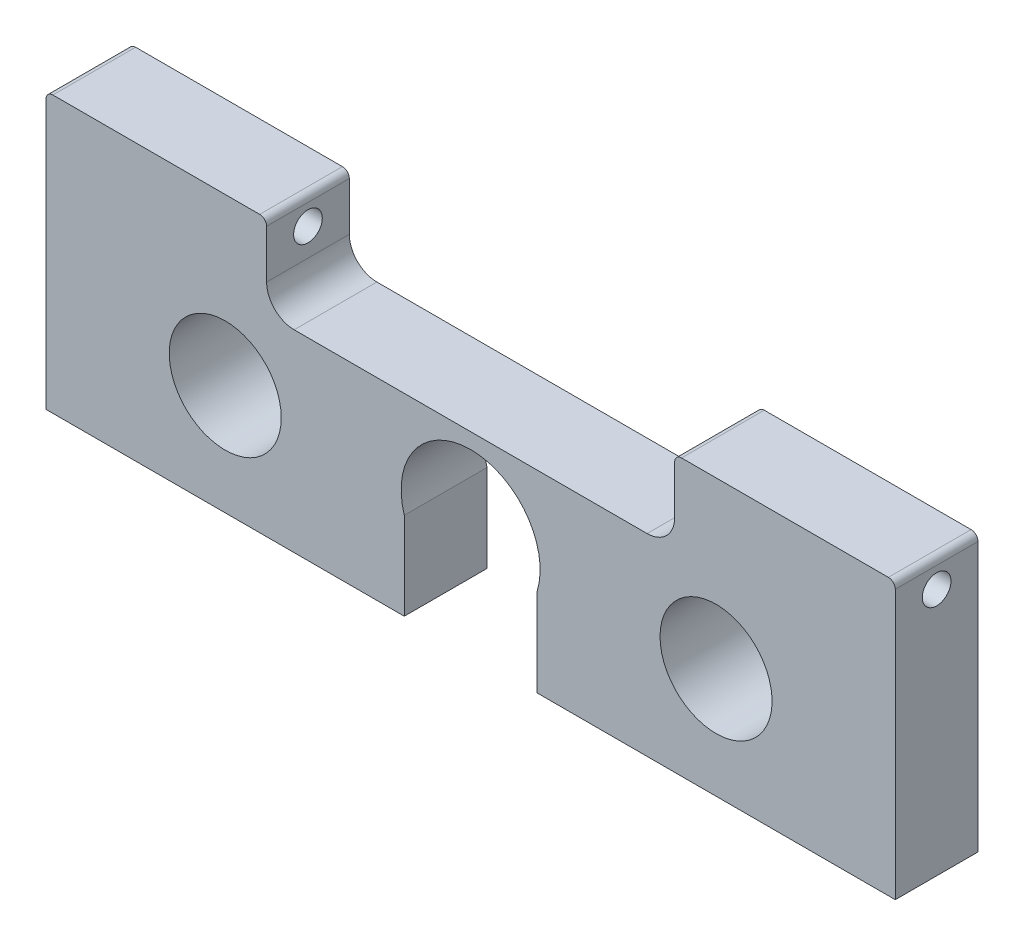
ISO-10303-21;
HEADER;
FILE_DESCRIPTION(('STEP AP214'),'2;1');
FILE_NAME('part.step','',(''),(''),'','','');
FILE_SCHEMA(('AUTOMOTIVE_DESIGN { 1 0 10303 214 1 1 1 1 }'));
ENDSEC;
DATA;
#1=APPLICATION_CONTEXT('core data for automotive mechanical design processes');
#2=APPLICATION_PROTOCOL_DEFINITION('international standard','automotive_design',2000,#1);
#3=PRODUCT_CONTEXT('',#1,'mechanical');
#4=PRODUCT('Part','Part','',(#3));
#5=PRODUCT_RELATED_PRODUCT_CATEGORY('part','',(#4));
#6=PRODUCT_DEFINITION_FORMATION('','',#4);
#7=PRODUCT_DEFINITION_CONTEXT('part definition',#1,'design');
#8=PRODUCT_DEFINITION('design','',#6,#7);
#9=PRODUCT_DEFINITION_SHAPE('','',#8);
#10=(LENGTH_UNIT() NAMED_UNIT(*) SI_UNIT(.MILLI.,.METRE.));
#11=(NAMED_UNIT(*) PLANE_ANGLE_UNIT() SI_UNIT($,.RADIAN.));
#12=(NAMED_UNIT(*) SI_UNIT($,.STERADIAN.) SOLID_ANGLE_UNIT());
#13=UNCERTAINTY_MEASURE_WITH_UNIT(LENGTH_MEASURE(1.E-05),#10,'distance_accuracy_value','');
#14=(GEOMETRIC_REPRESENTATION_CONTEXT(3) GLOBAL_UNCERTAINTY_ASSIGNED_CONTEXT((#13)) GLOBAL_UNIT_ASSIGNED_CONTEXT((#10,
#11,#12)) REPRESENTATION_CONTEXT('',''));
#15=CARTESIAN_POINT('',(0.,0.,0.));
#16=DIRECTION('',(0.,0.,1.));
#17=DIRECTION('',(1.,0.,0.));
#18=AXIS2_PLACEMENT_3D('',#15,#16,#17);
#19=CARTESIAN_POINT('',(97.79,-19.05,19.05));
#20=DIRECTION('',(-1.,0.,0.));
#21=DIRECTION('',(0.,0.,1.));
#22=AXIS2_PLACEMENT_3D('',#19,#20,#21);
#23=PLANE('',#22);
#24=CARTESIAN_POINT('',(97.79,31.75,9.525));
#25=DIRECTION('',(-1.,0.,0.));
#26=DIRECTION('',(0.,0.,1.));
#27=AXIS2_PLACEMENT_3D('',#24,#25,#26);
#28=CIRCLE('',#27,3.302);
#29=CARTESIAN_POINT('',(97.79,31.75,12.827));
#30=VERTEX_POINT('',#29);
#31=EDGE_CURVE('E227',#30,#30,#28,.T.);
#32=ORIENTED_EDGE('',*,*,#31,.T.);
#33=EDGE_LOOP('',(#32));
#34=FACE_BOUND('',#33,.T.);
#35=DIRECTION('',(0.,1.,0.));
#36=VECTOR('',#35,1.);
#37=CARTESIAN_POINT('',(97.79,-19.05,0.));
#38=LINE('',#37,#36);
#39=CARTESIAN_POINT('',(97.79,-25.4,0.));
#40=VERTEX_POINT('',#39);
#41=CARTESIAN_POINT('',(97.79,36.5125,0.));
#42=VERTEX_POINT('',#41);
#43=EDGE_CURVE('E199',#40,#42,#38,.T.);
#44=ORIENTED_EDGE('',*,*,#43,.T.);
#45=DIRECTION('',(0.,0.,-1.));
#46=VECTOR('',#45,1.);
#47=CARTESIAN_POINT('',(97.79,36.5125,19.05));
#48=LINE('',#47,#46);
#49=CARTESIAN_POINT('',(97.79,36.5125,19.05));
#50=VERTEX_POINT('',#49);
#51=EDGE_CURVE('E271',#42,#50,#48,.F.);
#52=ORIENTED_EDGE('',*,*,#51,.T.);
#53=DIRECTION('',(0.,1.,0.));
#54=VECTOR('',#53,1.);
#55=CARTESIAN_POINT('',(97.79,-19.05,19.05));
#56=LINE('',#55,#54);
#57=CARTESIAN_POINT('',(97.79,-25.4,19.05));
#58=VERTEX_POINT('',#57);
#59=EDGE_CURVE('E202',#58,#50,#56,.T.);
#60=ORIENTED_EDGE('',*,*,#59,.F.);
#61=DIRECTION('',(0.,0.,1.));
#62=VECTOR('',#61,1.);
#63=CARTESIAN_POINT('',(97.79,-25.4,-87.0286549798374));
#64=LINE('',#63,#62);
#65=EDGE_CURVE('E324',#40,#58,#64,.T.);
#66=ORIENTED_EDGE('',*,*,#65,.F.);
#67=EDGE_LOOP('',(#44,#52,#60,#66));
#68=FACE_BOUND('',#67,.T.);
#69=ADVANCED_FACE('F35',(#34,#68),#23,.F.);
#70=CARTESIAN_POINT('',(-97.79,19.05,19.05));
#71=DIRECTION('',(0.,-1.,0.));
#72=DIRECTION('',(0.,0.,-1.));
#73=AXIS2_PLACEMENT_3D('',#70,#71,#72);
#74=PLANE('',#73);
#75=DIRECTION('',(-1.,0.,0.));
#76=VECTOR('',#75,1.);
#77=CARTESIAN_POINT('',(-97.79,19.05,19.05));
#78=LINE('',#77,#76);
#79=CARTESIAN_POINT('',(40.64,19.05,19.05));
#80=VERTEX_POINT('',#79);
#81=CARTESIAN_POINT('',(-40.64,19.05,19.05));
#82=VERTEX_POINT('',#81);
#83=EDGE_CURVE('E205',#80,#82,#78,.T.);
#84=ORIENTED_EDGE('',*,*,#83,.F.);
#85=DIRECTION('',(0.,0.,1.));
#86=VECTOR('',#85,1.);
#87=CARTESIAN_POINT('',(40.64,19.05,19.05));
#88=LINE('',#87,#86);
#89=CARTESIAN_POINT('',(40.64,19.05,0.));
#90=VERTEX_POINT('',#89);
#91=EDGE_CURVE('E233',#80,#90,#88,.F.);
#92=ORIENTED_EDGE('',*,*,#91,.T.);
#93=DIRECTION('',(-1.,0.,0.));
#94=VECTOR('',#93,1.);
#95=CARTESIAN_POINT('',(-97.79,19.05,0.));
#96=LINE('',#95,#94);
#97=CARTESIAN_POINT('',(-40.64,19.05,0.));
#98=VERTEX_POINT('',#97);
#99=EDGE_CURVE('E214',#90,#98,#96,.T.);
#100=ORIENTED_EDGE('',*,*,#99,.T.);
#101=DIRECTION('',(0.,0.,1.));
#102=VECTOR('',#101,1.);
#103=CARTESIAN_POINT('',(-40.64,19.05,19.05));
#104=LINE('',#103,#102);
#105=EDGE_CURVE('E230',#98,#82,#104,.T.);
#106=ORIENTED_EDGE('',*,*,#105,.T.);
#107=EDGE_LOOP('',(#84,#92,#100,#106));
#108=FACE_BOUND('',#107,.T.);
#109=ADVANCED_FACE('F369',(#108),#74,.F.);
#110=CARTESIAN_POINT('',(-97.79,-19.05,19.05));
#111=DIRECTION('',(1.,0.,0.));
#112=DIRECTION('',(0.,0.,-1.));
#113=AXIS2_PLACEMENT_3D('',#110,#111,#112);
#114=PLANE('',#113);
#115=CARTESIAN_POINT('',(-97.79,31.75,9.525));
#116=DIRECTION('',(-1.,0.,0.));
#117=DIRECTION('',(0.,0.,1.));
#118=AXIS2_PLACEMENT_3D('',#115,#116,#117);
#119=CIRCLE('',#118,3.302);
#120=CARTESIAN_POINT('',(-97.79,31.75,12.827));
#121=VERTEX_POINT('',#120);
#122=EDGE_CURVE('E222',#121,#121,#119,.T.);
#123=ORIENTED_EDGE('',*,*,#122,.F.);
#124=EDGE_LOOP('',(#123));
#125=FACE_BOUND('',#124,.T.);
#126=DIRECTION('',(0.,-1.,0.));
#127=VECTOR('',#126,1.);
#128=CARTESIAN_POINT('',(-97.79,-19.05,19.05));
#129=LINE('',#128,#127);
#130=CARTESIAN_POINT('',(-97.79,36.5125,19.05));
#131=VERTEX_POINT('',#130);
#132=CARTESIAN_POINT('',(-97.79,-25.4,19.05));
#133=VERTEX_POINT('',#132);
#134=EDGE_CURVE('E209',#131,#133,#129,.T.);
#135=ORIENTED_EDGE('',*,*,#134,.F.);
#136=DIRECTION('',(0.,0.,-1.));
#137=VECTOR('',#136,1.);
#138=CARTESIAN_POINT('',(-97.79,36.5125,0.));
#139=LINE('',#138,#137);
#140=CARTESIAN_POINT('',(-97.79,36.5125,0.));
#141=VERTEX_POINT('',#140);
#142=EDGE_CURVE('E12',#131,#141,#139,.T.);
#143=ORIENTED_EDGE('',*,*,#142,.T.);
#144=DIRECTION('',(0.,-1.,0.));
#145=VECTOR('',#144,1.);
#146=CARTESIAN_POINT('',(-97.79,-19.05,0.));
#147=LINE('',#146,#145);
#148=CARTESIAN_POINT('',(-97.79,-25.4,0.));
#149=VERTEX_POINT('',#148);
#150=EDGE_CURVE('E206',#141,#149,#147,.T.);
#151=ORIENTED_EDGE('',*,*,#150,.T.);
#152=DIRECTION('',(0.,0.,1.));
#153=VECTOR('',#152,1.);
#154=CARTESIAN_POINT('',(-97.79,-25.4,-87.0286549798374));
#155=LINE('',#154,#153);
#156=EDGE_CURVE('E317',#149,#133,#155,.T.);
#157=ORIENTED_EDGE('',*,*,#156,.T.);
#158=EDGE_LOOP('',(#135,#143,#151,#157));
#159=FACE_BOUND('',#158,.T.);
#160=ADVANCED_FACE('F392',(#125,#159),#114,.F.);
#161=CARTESIAN_POINT('',(0.,0.,19.05));
#162=DIRECTION('',(0.,0.,-1.));
#163=DIRECTION('',(-1.,0.,0.));
#164=AXIS2_PLACEMENT_3D('',#161,#162,#163);
#165=PLANE('',#164);
#166=CARTESIAN_POINT('',(56.5150000000001,0.,19.05));
#167=DIRECTION('',(0.,0.,1.));
#168=DIRECTION('',(-1.,0.,0.));
#169=AXIS2_PLACEMENT_3D('',#166,#167,#168);
#170=CIRCLE('',#169,12.8984375);
#171=CARTESIAN_POINT('',(43.6165625000001,0.,19.05));
#172=VERTEX_POINT('',#171);
#173=EDGE_CURVE('E176',#172,#172,#170,.T.);
#174=ORIENTED_EDGE('',*,*,#173,.F.);
#175=EDGE_LOOP('',(#174));
#176=FACE_BOUND('',#175,.T.);
#177=CARTESIAN_POINT('',(-56.515,0.,19.05));
#178=DIRECTION('',(0.,0.,1.));
#179=DIRECTION('',(1.,0.,0.));
#180=AXIS2_PLACEMENT_3D('',#177,#178,#179);
#181=CIRCLE('',#180,12.8984375);
#182=CARTESIAN_POINT('',(-43.6165625,0.,19.05));
#183=VERTEX_POINT('',#182);
#184=EDGE_CURVE('E193',#183,#183,#181,.T.);
#185=ORIENTED_EDGE('',*,*,#184,.F.);
#186=EDGE_LOOP('',(#185));
#187=FACE_BOUND('',#186,.T.);
#188=CARTESIAN_POINT('',(0.,-0.508,19.05));
#189=DIRECTION('',(0.,0.,1.));
#190=DIRECTION('',(1.,0.,0.));
#191=AXIS2_PLACEMENT_3D('',#188,#189,#190);
#192=CIRCLE('',#191,16.0019999876822);
#193=CARTESIAN_POINT('',(15.2818809037791,-5.25437963594282,19.05));
#194=VERTEX_POINT('',#193);
#195=CARTESIAN_POINT('',(-15.2818809037791,-5.25437963594281,19.05));
#196=VERTEX_POINT('',#195);
#197=EDGE_CURVE('E175',#194,#196,#192,.T.);
#198=ORIENTED_EDGE('',*,*,#197,.F.);
#199=DIRECTION('',(0.,-1.,0.));
#200=VECTOR('',#199,1.);
#201=CARTESIAN_POINT('',(15.2818809037791,0.,19.05));
#202=LINE('',#201,#200);
#203=CARTESIAN_POINT('',(15.2818809037791,-25.4,19.05));
#204=VERTEX_POINT('',#203);
#205=EDGE_CURVE('E332',#194,#204,#202,.T.);
#206=ORIENTED_EDGE('',*,*,#205,.T.);
#207=DIRECTION('',(1.,0.,0.));
#208=VECTOR('',#207,1.);
#209=CARTESIAN_POINT('',(10.9933163790253,-25.4,19.05));
#210=LINE('',#209,#208);
#211=EDGE_CURVE('E329',#204,#58,#210,.T.);
#212=ORIENTED_EDGE('',*,*,#211,.T.);
#213=ORIENTED_EDGE('',*,*,#59,.T.);
#214=CARTESIAN_POINT('',(96.2025,36.5125,19.05));
#215=DIRECTION('',(0.,0.,-1.));
#216=DIRECTION('',(-1.,0.,0.));
#217=AXIS2_PLACEMENT_3D('',#214,#215,#216);
#218=CIRCLE('',#217,1.5875);
#219=CARTESIAN_POINT('',(96.2025,38.1,19.05));
#220=VERTEX_POINT('',#219);
#221=EDGE_CURVE('E267',#50,#220,#218,.F.);
#222=ORIENTED_EDGE('',*,*,#221,.T.);
#223=DIRECTION('',(1.,0.,0.));
#224=VECTOR('',#223,1.);
#225=CARTESIAN_POINT('',(46.99,38.1,19.05));
#226=LINE('',#225,#224);
#227=CARTESIAN_POINT('',(48.5775,38.1,19.05));
#228=VERTEX_POINT('',#227);
#229=EDGE_CURVE('E304',#228,#220,#226,.T.);
#230=ORIENTED_EDGE('',*,*,#229,.F.);
#231=CARTESIAN_POINT('',(48.5775,36.5125,19.05));
#232=DIRECTION('',(0.,0.,-1.));
#233=DIRECTION('',(-1.,0.,0.));
#234=AXIS2_PLACEMENT_3D('',#231,#232,#233);
#235=CIRCLE('',#234,1.5875);
#236=CARTESIAN_POINT('',(46.99,36.5125,19.05));
#237=VERTEX_POINT('',#236);
#238=EDGE_CURVE('E269',#228,#237,#235,.F.);
#239=ORIENTED_EDGE('',*,*,#238,.T.);
#240=DIRECTION('',(0.,1.,0.));
#241=VECTOR('',#240,1.);
#242=CARTESIAN_POINT('',(46.99,19.05,19.05));
#243=LINE('',#242,#241);
#244=CARTESIAN_POINT('',(46.99,25.4,19.05));
#245=VERTEX_POINT('',#244);
#246=EDGE_CURVE('E308',#245,#237,#243,.T.);
#247=ORIENTED_EDGE('',*,*,#246,.F.);
#248=CARTESIAN_POINT('',(40.64,25.4,19.05));
#249=DIRECTION('',(0.,0.,-1.));
#250=DIRECTION('',(-1.,0.,0.));
#251=AXIS2_PLACEMENT_3D('',#248,#249,#250);
#252=CIRCLE('',#251,6.35);
#253=EDGE_CURVE('E238',#245,#80,#252,.T.);
#254=ORIENTED_EDGE('',*,*,#253,.T.);
#255=ORIENTED_EDGE('',*,*,#83,.T.);
#256=CARTESIAN_POINT('',(-40.64,25.4,19.05));
#257=DIRECTION('',(0.,0.,-1.));
#258=DIRECTION('',(-1.,0.,0.));
#259=AXIS2_PLACEMENT_3D('',#256,#257,#258);
#260=CIRCLE('',#259,6.35);
#261=CARTESIAN_POINT('',(-46.99,25.4,19.05));
#262=VERTEX_POINT('',#261);
#263=EDGE_CURVE('E243',#82,#262,#260,.T.);
#264=ORIENTED_EDGE('',*,*,#263,.T.);
#265=DIRECTION('',(0.,1.,0.));
#266=VECTOR('',#265,1.);
#267=CARTESIAN_POINT('',(-46.99,19.05,19.05));
#268=LINE('',#267,#266);
#269=CARTESIAN_POINT('',(-46.99,36.5125,19.05));
#270=VERTEX_POINT('',#269);
#271=EDGE_CURVE('E283',#262,#270,#268,.T.);
#272=ORIENTED_EDGE('',*,*,#271,.T.);
#273=CARTESIAN_POINT('',(-48.5775,36.5125,19.05));
#274=DIRECTION('',(0.,0.,-1.));
#275=DIRECTION('',(-1.,0.,0.));
#276=AXIS2_PLACEMENT_3D('',#273,#274,#275);
#277=CIRCLE('',#276,1.5875);
#278=CARTESIAN_POINT('',(-48.5775,38.1,19.05));
#279=VERTEX_POINT('',#278);
#280=EDGE_CURVE('E265',#270,#279,#277,.F.);
#281=ORIENTED_EDGE('',*,*,#280,.T.);
#282=DIRECTION('',(-1.,0.,0.));
#283=VECTOR('',#282,1.);
#284=CARTESIAN_POINT('',(-46.99,38.1,19.05));
#285=LINE('',#284,#283);
#286=CARTESIAN_POINT('',(-96.2025,38.1,19.05));
#287=VERTEX_POINT('',#286);
#288=EDGE_CURVE('E187',#279,#287,#285,.T.);
#289=ORIENTED_EDGE('',*,*,#288,.T.);
#290=CARTESIAN_POINT('',(-96.2025,36.5125,19.05));
#291=DIRECTION('',(0.,0.,-1.));
#292=DIRECTION('',(-1.,0.,0.));
#293=AXIS2_PLACEMENT_3D('',#290,#291,#292);
#294=CIRCLE('',#293,1.5875);
#295=EDGE_CURVE('E263',#287,#131,#294,.F.);
#296=ORIENTED_EDGE('',*,*,#295,.T.);
#297=ORIENTED_EDGE('',*,*,#134,.T.);
#298=DIRECTION('',(1.,0.,0.));
#299=VECTOR('',#298,1.);
#300=CARTESIAN_POINT('',(-97.79,-25.4,19.05));
#301=LINE('',#300,#299);
#302=CARTESIAN_POINT('',(-15.2818809037791,-25.4,19.05));
#303=VERTEX_POINT('',#302);
#304=EDGE_CURVE('E320',#133,#303,#301,.T.);
#305=ORIENTED_EDGE('',*,*,#304,.T.);
#306=DIRECTION('',(0.,1.,0.));
#307=VECTOR('',#306,1.);
#308=CARTESIAN_POINT('',(-15.2818809037791,0.,19.05));
#309=LINE('',#308,#307);
#310=EDGE_CURVE('E50',#303,#196,#309,.T.);
#311=ORIENTED_EDGE('',*,*,#310,.T.);
#312=EDGE_LOOP('',(#198,#206,#212,#213,#222,#230,#239,#247,#254,#255,#264,#272,#281,#289,#296,
#297,#305,#311));
#313=FACE_BOUND('',#312,.T.);
#314=ADVANCED_FACE('F288',(#176,#187,#313),#165,.F.);
#315=CARTESIAN_POINT('',(0.,0.,0.));
#316=DIRECTION('',(0.,0.,-1.));
#317=DIRECTION('',(-1.,0.,0.));
#318=AXIS2_PLACEMENT_3D('',#315,#316,#317);
#319=PLANE('',#318);
#320=DIRECTION('',(0.,1.,0.));
#321=VECTOR('',#320,1.);
#322=CARTESIAN_POINT('',(15.2818809037791,-5.25437963594282,0.));
#323=LINE('',#322,#321);
#324=CARTESIAN_POINT('',(15.2818809037791,-25.4,0.));
#325=VERTEX_POINT('',#324);
#326=CARTESIAN_POINT('',(15.2818809037791,-5.25437963594282,0.));
#327=VERTEX_POINT('',#326);
#328=EDGE_CURVE('E58',#325,#327,#323,.T.);
#329=ORIENTED_EDGE('',*,*,#328,.T.);
#330=CARTESIAN_POINT('',(0.,-0.508,0.));
#331=DIRECTION('',(0.,0.,1.));
#332=DIRECTION('',(1.,0.,0.));
#333=AXIS2_PLACEMENT_3D('',#330,#331,#332);
#334=CIRCLE('',#333,16.0019999876822);
#335=CARTESIAN_POINT('',(-15.2818809037791,-5.25437963594281,0.));
#336=VERTEX_POINT('',#335);
#337=EDGE_CURVE('E173',#327,#336,#334,.T.);
#338=ORIENTED_EDGE('',*,*,#337,.T.);
#339=DIRECTION('',(0.,-1.,0.));
#340=VECTOR('',#339,1.);
#341=CARTESIAN_POINT('',(-15.2818809037791,-5.25437963594281,0.));
#342=LINE('',#341,#340);
#343=CARTESIAN_POINT('',(-15.2818809037791,-25.4,0.));
#344=VERTEX_POINT('',#343);
#345=EDGE_CURVE('E158',#336,#344,#342,.T.);
#346=ORIENTED_EDGE('',*,*,#345,.T.);
#347=DIRECTION('',(1.,0.,0.));
#348=VECTOR('',#347,1.);
#349=CARTESIAN_POINT('',(-97.79,-25.4,0.));
#350=LINE('',#349,#348);
#351=EDGE_CURVE('E316',#149,#344,#350,.T.);
#352=ORIENTED_EDGE('',*,*,#351,.F.);
#353=ORIENTED_EDGE('',*,*,#150,.F.);
#354=CARTESIAN_POINT('',(-96.2025,36.5125,0.));
#355=DIRECTION('',(0.,0.,-1.));
#356=DIRECTION('',(-1.,0.,0.));
#357=AXIS2_PLACEMENT_3D('',#354,#355,#356);
#358=CIRCLE('',#357,1.5875);
#359=CARTESIAN_POINT('',(-96.2025,38.1,0.));
#360=VERTEX_POINT('',#359);
#361=EDGE_CURVE('E250',#141,#360,#358,.T.);
#362=ORIENTED_EDGE('',*,*,#361,.T.);
#363=DIRECTION('',(-1.,0.,0.));
#364=VECTOR('',#363,1.);
#365=CARTESIAN_POINT('',(-46.99,38.1,0.));
#366=LINE('',#365,#364);
#367=CARTESIAN_POINT('',(-48.5775,38.1,0.));
#368=VERTEX_POINT('',#367);
#369=EDGE_CURVE('E184',#368,#360,#366,.T.);
#370=ORIENTED_EDGE('',*,*,#369,.F.);
#371=CARTESIAN_POINT('',(-48.5775,36.5125,0.));
#372=DIRECTION('',(0.,0.,-1.));
#373=DIRECTION('',(-1.,0.,0.));
#374=AXIS2_PLACEMENT_3D('',#371,#372,#373);
#375=CIRCLE('',#374,1.5875);
#376=CARTESIAN_POINT('',(-46.99,36.5125,0.));
#377=VERTEX_POINT('',#376);
#378=EDGE_CURVE('E252',#368,#377,#375,.T.);
#379=ORIENTED_EDGE('',*,*,#378,.T.);
#380=DIRECTION('',(0.,-1.,0.));
#381=VECTOR('',#380,1.);
#382=CARTESIAN_POINT('',(-46.99,19.05,0.));
#383=LINE('',#382,#381);
#384=CARTESIAN_POINT('',(-46.99,25.4,0.));
#385=VERTEX_POINT('',#384);
#386=EDGE_CURVE('E221',#377,#385,#383,.T.);
#387=ORIENTED_EDGE('',*,*,#386,.T.);
#388=CARTESIAN_POINT('',(-40.64,25.4,0.));
#389=DIRECTION('',(0.,0.,-1.));
#390=DIRECTION('',(-1.,0.,0.));
#391=AXIS2_PLACEMENT_3D('',#388,#389,#390);
#392=CIRCLE('',#391,6.35);
#393=EDGE_CURVE('E245',#385,#98,#392,.F.);
#394=ORIENTED_EDGE('',*,*,#393,.T.);
#395=ORIENTED_EDGE('',*,*,#99,.F.);
#396=CARTESIAN_POINT('',(40.64,25.4,0.));
#397=DIRECTION('',(0.,0.,-1.));
#398=DIRECTION('',(-1.,0.,0.));
#399=AXIS2_PLACEMENT_3D('',#396,#397,#398);
#400=CIRCLE('',#399,6.35);
#401=CARTESIAN_POINT('',(46.99,25.4,0.));
#402=VERTEX_POINT('',#401);
#403=EDGE_CURVE('E240',#90,#402,#400,.F.);
#404=ORIENTED_EDGE('',*,*,#403,.T.);
#405=DIRECTION('',(0.,-1.,0.));
#406=VECTOR('',#405,1.);
#407=CARTESIAN_POINT('',(46.99,19.05,0.));
#408=LINE('',#407,#406);
#409=CARTESIAN_POINT('',(46.99,36.5125,0.));
#410=VERTEX_POINT('',#409);
#411=EDGE_CURVE('E226',#410,#402,#408,.T.);
#412=ORIENTED_EDGE('',*,*,#411,.F.);
#413=CARTESIAN_POINT('',(48.5775,36.5125,0.));
#414=DIRECTION('',(0.,0.,-1.));
#415=DIRECTION('',(-1.,0.,0.));
#416=AXIS2_PLACEMENT_3D('',#413,#414,#415);
#417=CIRCLE('',#416,1.5875);
#418=CARTESIAN_POINT('',(48.5775,38.1,0.));
#419=VERTEX_POINT('',#418);
#420=EDGE_CURVE('E256',#410,#419,#417,.T.);
#421=ORIENTED_EDGE('',*,*,#420,.T.);
#422=DIRECTION('',(1.,0.,0.));
#423=VECTOR('',#422,1.);
#424=CARTESIAN_POINT('',(46.99,38.1,0.));
#425=LINE('',#424,#423);
#426=CARTESIAN_POINT('',(96.2025,38.1,0.));
#427=VERTEX_POINT('',#426);
#428=EDGE_CURVE('E305',#419,#427,#425,.T.);
#429=ORIENTED_EDGE('',*,*,#428,.T.);
#430=CARTESIAN_POINT('',(96.2025,36.5125,0.));
#431=DIRECTION('',(0.,0.,-1.));
#432=DIRECTION('',(-1.,0.,0.));
#433=AXIS2_PLACEMENT_3D('',#430,#431,#432);
#434=CIRCLE('',#433,1.5875);
#435=EDGE_CURVE('E254',#427,#42,#434,.T.);
#436=ORIENTED_EDGE('',*,*,#435,.T.);
#437=ORIENTED_EDGE('',*,*,#43,.F.);
#438=DIRECTION('',(1.,0.,0.));
#439=VECTOR('',#438,1.);
#440=CARTESIAN_POINT('',(10.9933163790253,-25.4,0.));
#441=LINE('',#440,#439);
#442=EDGE_CURVE('E327',#325,#40,#441,.T.);
#443=ORIENTED_EDGE('',*,*,#442,.F.);
#444=EDGE_LOOP('',(#329,#338,#346,#352,#353,#362,#370,#379,#387,#394,#395,#404,#412,#421,#429,
#436,#437,#443));
#445=FACE_BOUND('',#444,.T.);
#446=CARTESIAN_POINT('',(56.5150000000001,0.,0.));
#447=DIRECTION('',(0.,0.,1.));
#448=DIRECTION('',(-1.,0.,0.));
#449=AXIS2_PLACEMENT_3D('',#446,#447,#448);
#450=CIRCLE('',#449,12.8984375);
#451=CARTESIAN_POINT('',(43.6165625000001,0.,0.));
#452=VERTEX_POINT('',#451);
#453=EDGE_CURVE('E190',#452,#452,#450,.T.);
#454=ORIENTED_EDGE('',*,*,#453,.T.);
#455=EDGE_LOOP('',(#454));
#456=FACE_BOUND('',#455,.T.);
#457=CARTESIAN_POINT('',(-56.515,0.,0.));
#458=DIRECTION('',(0.,0.,1.));
#459=DIRECTION('',(1.,0.,0.));
#460=AXIS2_PLACEMENT_3D('',#457,#458,#459);
#461=CIRCLE('',#460,12.8984375);
#462=CARTESIAN_POINT('',(-43.6165625,0.,0.));
#463=VERTEX_POINT('',#462);
#464=EDGE_CURVE('E196',#463,#463,#461,.T.);
#465=ORIENTED_EDGE('',*,*,#464,.T.);
#466=EDGE_LOOP('',(#465));
#467=FACE_BOUND('',#466,.T.);
#468=ADVANCED_FACE('F179',(#445,#456,#467),#319,.T.);
#469=CARTESIAN_POINT('',(-56.515,0.,0.));
#470=DIRECTION('',(0.,0.,1.));
#471=DIRECTION('',(1.,0.,0.));
#472=AXIS2_PLACEMENT_3D('',#469,#470,#471);
#473=CYLINDRICAL_SURFACE('',#472,12.8984375);
#474=ORIENTED_EDGE('',*,*,#464,.F.);
#475=EDGE_LOOP('',(#474));
#476=FACE_BOUND('',#475,.T.);
#477=ORIENTED_EDGE('',*,*,#184,.T.);
#478=EDGE_LOOP('',(#477));
#479=FACE_BOUND('',#478,.T.);
#480=ADVANCED_FACE('F400',(#476,#479),#473,.F.);
#481=CARTESIAN_POINT('',(56.5150000000001,0.,0.));
#482=DIRECTION('',(0.,0.,1.));
#483=DIRECTION('',(1.,0.,0.));
#484=AXIS2_PLACEMENT_3D('',#481,#482,#483);
#485=CYLINDRICAL_SURFACE('',#484,12.8984375);
#486=ORIENTED_EDGE('',*,*,#453,.F.);
#487=EDGE_LOOP('',(#486));
#488=FACE_BOUND('',#487,.T.);
#489=ORIENTED_EDGE('',*,*,#173,.T.);
#490=EDGE_LOOP('',(#489));
#491=FACE_BOUND('',#490,.T.);
#492=ADVANCED_FACE('F406',(#488,#491),#485,.F.);
#493=CARTESIAN_POINT('',(0.,-0.508,0.));
#494=DIRECTION('',(0.,0.,1.));
#495=DIRECTION('',(1.,0.,0.));
#496=AXIS2_PLACEMENT_3D('',#493,#494,#495);
#497=CYLINDRICAL_SURFACE('',#496,16.0019999876822);
#498=ORIENTED_EDGE('',*,*,#197,.T.);
#499=DIRECTION('',(0.,0.,1.));
#500=VECTOR('',#499,1.);
#501=CARTESIAN_POINT('',(-15.2818809037791,-5.25437963594281,0.));
#502=LINE('',#501,#500);
#503=EDGE_CURVE('E161',#336,#196,#502,.T.);
#504=ORIENTED_EDGE('',*,*,#503,.F.);
#505=ORIENTED_EDGE('',*,*,#337,.F.);
#506=DIRECTION('',(0.,0.,1.));
#507=VECTOR('',#506,1.);
#508=CARTESIAN_POINT('',(15.2818809037791,-5.25437963594282,0.));
#509=LINE('',#508,#507);
#510=EDGE_CURVE('E177',#327,#194,#509,.T.);
#511=ORIENTED_EDGE('',*,*,#510,.T.);
#512=EDGE_LOOP('',(#498,#504,#505,#511));
#513=FACE_BOUND('',#512,.T.);
#514=ADVANCED_FACE('F171',(#513),#497,.F.);
#515=CARTESIAN_POINT('',(-46.99,38.1,0.));
#516=DIRECTION('',(0.,1.,0.));
#517=DIRECTION('',(0.,0.,1.));
#518=AXIS2_PLACEMENT_3D('',#515,#516,#517);
#519=PLANE('',#518);
#520=ORIENTED_EDGE('',*,*,#288,.F.);
#521=DIRECTION('',(0.,0.,-1.));
#522=VECTOR('',#521,1.);
#523=CARTESIAN_POINT('',(-48.5775,38.1,0.));
#524=LINE('',#523,#522);
#525=EDGE_CURVE('E275',#279,#368,#524,.T.);
#526=ORIENTED_EDGE('',*,*,#525,.T.);
#527=ORIENTED_EDGE('',*,*,#369,.T.);
#528=DIRECTION('',(0.,0.,-1.));
#529=VECTOR('',#528,1.);
#530=CARTESIAN_POINT('',(-96.2025,38.1,19.05));
#531=LINE('',#530,#529);
#532=EDGE_CURVE('E273',#360,#287,#531,.F.);
#533=ORIENTED_EDGE('',*,*,#532,.T.);
#534=EDGE_LOOP('',(#520,#526,#527,#533));
#535=FACE_BOUND('',#534,.T.);
#536=ADVANCED_FACE('F297',(#535),#519,.T.);
#537=CARTESIAN_POINT('',(-46.99,0.,0.));
#538=DIRECTION('',(1.,0.,0.));
#539=DIRECTION('',(0.,0.,-1.));
#540=AXIS2_PLACEMENT_3D('',#537,#538,#539);
#541=PLANE('',#540);
#542=CARTESIAN_POINT('',(-46.99,31.75,9.525));
#543=DIRECTION('',(1.,0.,0.));
#544=DIRECTION('',(0.,0.,-1.));
#545=AXIS2_PLACEMENT_3D('',#542,#543,#544);
#546=CIRCLE('',#545,3.302);
#547=CARTESIAN_POINT('',(-46.99,31.75,6.223));
#548=VERTEX_POINT('',#547);
#549=EDGE_CURVE('E218',#548,#548,#546,.T.);
#550=ORIENTED_EDGE('',*,*,#549,.F.);
#551=EDGE_LOOP('',(#550));
#552=FACE_BOUND('',#551,.T.);
#553=ORIENTED_EDGE('',*,*,#386,.F.);
#554=DIRECTION('',(0.,0.,-1.));
#555=VECTOR('',#554,1.);
#556=CARTESIAN_POINT('',(-46.99,36.5125,0.));
#557=LINE('',#556,#555);
#558=EDGE_CURVE('E43',#377,#270,#557,.F.);
#559=ORIENTED_EDGE('',*,*,#558,.T.);
#560=ORIENTED_EDGE('',*,*,#271,.F.);
#561=DIRECTION('',(0.,0.,1.));
#562=VECTOR('',#561,1.);
#563=CARTESIAN_POINT('',(-46.99,25.4,0.));
#564=LINE('',#563,#562);
#565=EDGE_CURVE('E235',#262,#385,#564,.F.);
#566=ORIENTED_EDGE('',*,*,#565,.T.);
#567=EDGE_LOOP('',(#553,#559,#560,#566));
#568=FACE_BOUND('',#567,.T.);
#569=ADVANCED_FACE('F282',(#552,#568),#541,.T.);
#570=CARTESIAN_POINT('',(97.79,31.75,9.525));
#571=DIRECTION('',(-1.,0.,0.));
#572=DIRECTION('',(0.,0.,1.));
#573=AXIS2_PLACEMENT_3D('',#570,#571,#572);
#574=CYLINDRICAL_SURFACE('',#573,3.302);
#575=ORIENTED_EDGE('',*,*,#549,.T.);
#576=EDGE_LOOP('',(#575));
#577=FACE_BOUND('',#576,.T.);
#578=ORIENTED_EDGE('',*,*,#122,.T.);
#579=EDGE_LOOP('',(#578));
#580=FACE_BOUND('',#579,.T.);
#581=ADVANCED_FACE('F417',(#577,#580),#574,.F.);
#582=CARTESIAN_POINT('',(46.99,38.1,0.));
#583=DIRECTION('',(0.,-1.,0.));
#584=DIRECTION('',(0.,0.,-1.));
#585=AXIS2_PLACEMENT_3D('',#582,#583,#584);
#586=PLANE('',#585);
#587=ORIENTED_EDGE('',*,*,#428,.F.);
#588=DIRECTION('',(0.,0.,-1.));
#589=VECTOR('',#588,1.);
#590=CARTESIAN_POINT('',(48.5775,38.1,19.05));
#591=LINE('',#590,#589);
#592=EDGE_CURVE('E261',#419,#228,#591,.F.);
#593=ORIENTED_EDGE('',*,*,#592,.T.);
#594=ORIENTED_EDGE('',*,*,#229,.T.);
#595=DIRECTION('',(0.,0.,-1.));
#596=VECTOR('',#595,1.);
#597=CARTESIAN_POINT('',(96.2025,38.1,0.));
#598=LINE('',#597,#596);
#599=EDGE_CURVE('E258',#220,#427,#598,.T.);
#600=ORIENTED_EDGE('',*,*,#599,.T.);
#601=EDGE_LOOP('',(#587,#593,#594,#600));
#602=FACE_BOUND('',#601,.T.);
#603=ADVANCED_FACE('F354',(#602),#586,.F.);
#604=CARTESIAN_POINT('',(46.99,0.,0.));
#605=DIRECTION('',(-1.,0.,0.));
#606=DIRECTION('',(0.,0.,-1.));
#607=AXIS2_PLACEMENT_3D('',#604,#605,#606);
#608=PLANE('',#607);
#609=CARTESIAN_POINT('',(46.99,31.75,9.525));
#610=DIRECTION('',(-1.,0.,0.));
#611=DIRECTION('',(0.,0.,1.));
#612=AXIS2_PLACEMENT_3D('',#609,#610,#611);
#613=CIRCLE('',#612,3.302);
#614=CARTESIAN_POINT('',(46.99,31.75,12.827));
#615=VERTEX_POINT('',#614);
#616=EDGE_CURVE('E223',#615,#615,#613,.F.);
#617=ORIENTED_EDGE('',*,*,#616,.T.);
#618=EDGE_LOOP('',(#617));
#619=FACE_BOUND('',#618,.T.);
#620=ORIENTED_EDGE('',*,*,#246,.T.);
#621=DIRECTION('',(0.,0.,-1.));
#622=VECTOR('',#621,1.);
#623=CARTESIAN_POINT('',(46.99,36.5125,0.));
#624=LINE('',#623,#622);
#625=EDGE_CURVE('E247',#237,#410,#624,.T.);
#626=ORIENTED_EDGE('',*,*,#625,.T.);
#627=ORIENTED_EDGE('',*,*,#411,.T.);
#628=DIRECTION('',(0.,0.,1.));
#629=VECTOR('',#628,1.);
#630=CARTESIAN_POINT('',(46.99,25.4,0.));
#631=LINE('',#630,#629);
#632=EDGE_CURVE('E211',#402,#245,#631,.T.);
#633=ORIENTED_EDGE('',*,*,#632,.T.);
#634=EDGE_LOOP('',(#620,#626,#627,#633));
#635=FACE_BOUND('',#634,.T.);
#636=ADVANCED_FACE('F362',(#619,#635),#608,.T.);
#637=CARTESIAN_POINT('',(-97.79,31.75,9.525));
#638=DIRECTION('',(1.,0.,0.));
#639=DIRECTION('',(0.,0.,-1.));
#640=AXIS2_PLACEMENT_3D('',#637,#638,#639);
#641=CYLINDRICAL_SURFACE('',#640,3.302);
#642=ORIENTED_EDGE('',*,*,#616,.F.);
#643=EDGE_LOOP('',(#642));
#644=FACE_BOUND('',#643,.T.);
#645=ORIENTED_EDGE('',*,*,#31,.F.);
#646=EDGE_LOOP('',(#645));
#647=FACE_BOUND('',#646,.T.);
#648=ADVANCED_FACE('F384',(#644,#647),#641,.F.);
#649=CARTESIAN_POINT('',(40.64,25.4,0.));
#650=DIRECTION('',(0.,0.,1.));
#651=DIRECTION('',(1.,0.,0.));
#652=AXIS2_PLACEMENT_3D('',#649,#650,#651);
#653=CYLINDRICAL_SURFACE('',#652,6.35);
#654=ORIENTED_EDGE('',*,*,#403,.F.);
#655=ORIENTED_EDGE('',*,*,#91,.F.);
#656=ORIENTED_EDGE('',*,*,#253,.F.);
#657=ORIENTED_EDGE('',*,*,#632,.F.);
#658=EDGE_LOOP('',(#654,#655,#656,#657));
#659=FACE_BOUND('',#658,.T.);
#660=ADVANCED_FACE('F373',(#659),#653,.F.);
#661=CARTESIAN_POINT('',(-40.64,25.4,19.05));
#662=DIRECTION('',(0.,0.,1.));
#663=DIRECTION('',(1.,0.,0.));
#664=AXIS2_PLACEMENT_3D('',#661,#662,#663);
#665=CYLINDRICAL_SURFACE('',#664,6.35);
#666=ORIENTED_EDGE('',*,*,#393,.F.);
#667=ORIENTED_EDGE('',*,*,#565,.F.);
#668=ORIENTED_EDGE('',*,*,#263,.F.);
#669=ORIENTED_EDGE('',*,*,#105,.F.);
#670=EDGE_LOOP('',(#666,#667,#668,#669));
#671=FACE_BOUND('',#670,.T.);
#672=ADVANCED_FACE('F376',(#671),#665,.F.);
#673=CARTESIAN_POINT('',(48.5775,36.5125,0.));
#674=DIRECTION('',(0.,0.,1.));
#675=DIRECTION('',(1.,0.,0.));
#676=AXIS2_PLACEMENT_3D('',#673,#674,#675);
#677=CYLINDRICAL_SURFACE('',#676,1.5875);
#678=ORIENTED_EDGE('',*,*,#238,.F.);
#679=ORIENTED_EDGE('',*,*,#592,.F.);
#680=ORIENTED_EDGE('',*,*,#420,.F.);
#681=ORIENTED_EDGE('',*,*,#625,.F.);
#682=EDGE_LOOP('',(#678,#679,#680,#681));
#683=FACE_BOUND('',#682,.T.);
#684=ADVANCED_FACE('F360',(#683),#677,.T.);
#685=CARTESIAN_POINT('',(96.2025,36.5125,0.));
#686=DIRECTION('',(0.,0.,-1.));
#687=DIRECTION('',(-1.,0.,0.));
#688=AXIS2_PLACEMENT_3D('',#685,#686,#687);
#689=CYLINDRICAL_SURFACE('',#688,1.5875);
#690=ORIENTED_EDGE('',*,*,#221,.F.);
#691=ORIENTED_EDGE('',*,*,#51,.F.);
#692=ORIENTED_EDGE('',*,*,#435,.F.);
#693=ORIENTED_EDGE('',*,*,#599,.F.);
#694=EDGE_LOOP('',(#690,#691,#692,#693));
#695=FACE_BOUND('',#694,.T.);
#696=ADVANCED_FACE('F351',(#695),#689,.T.);
#697=CARTESIAN_POINT('',(-48.5775,36.5125,0.));
#698=DIRECTION('',(0.,0.,-1.));
#699=DIRECTION('',(-1.,0.,0.));
#700=AXIS2_PLACEMENT_3D('',#697,#698,#699);
#701=CYLINDRICAL_SURFACE('',#700,1.5875);
#702=ORIENTED_EDGE('',*,*,#280,.F.);
#703=ORIENTED_EDGE('',*,*,#558,.F.);
#704=ORIENTED_EDGE('',*,*,#378,.F.);
#705=ORIENTED_EDGE('',*,*,#525,.F.);
#706=EDGE_LOOP('',(#702,#703,#704,#705));
#707=FACE_BOUND('',#706,.T.);
#708=ADVANCED_FACE('F293',(#707),#701,.T.);
#709=CARTESIAN_POINT('',(-96.2025,36.5125,19.05));
#710=DIRECTION('',(0.,0.,1.));
#711=DIRECTION('',(1.,0.,0.));
#712=AXIS2_PLACEMENT_3D('',#709,#710,#711);
#713=CYLINDRICAL_SURFACE('',#712,1.5875);
#714=ORIENTED_EDGE('',*,*,#295,.F.);
#715=ORIENTED_EDGE('',*,*,#532,.F.);
#716=ORIENTED_EDGE('',*,*,#361,.F.);
#717=ORIENTED_EDGE('',*,*,#142,.F.);
#718=EDGE_LOOP('',(#714,#715,#716,#717));
#719=FACE_BOUND('',#718,.T.);
#720=ADVANCED_FACE('F37',(#719),#713,.T.);
#721=CARTESIAN_POINT('',(-97.79,-25.4,-87.0286549798374));
#722=DIRECTION('',(0.,-1.,0.));
#723=DIRECTION('',(0.,0.,-1.));
#724=AXIS2_PLACEMENT_3D('',#721,#722,#723);
#725=PLANE('',#724);
#726=DIRECTION('',(0.,0.,1.));
#727=VECTOR('',#726,1.);
#728=CARTESIAN_POINT('',(-15.2818809037791,-25.4,0.));
#729=LINE('',#728,#727);
#730=EDGE_CURVE('E162',#344,#303,#729,.T.);
#731=ORIENTED_EDGE('',*,*,#730,.T.);
#732=ORIENTED_EDGE('',*,*,#304,.F.);
#733=ORIENTED_EDGE('',*,*,#156,.F.);
#734=ORIENTED_EDGE('',*,*,#351,.T.);
#735=EDGE_LOOP('',(#731,#732,#733,#734));
#736=FACE_BOUND('',#735,.T.);
#737=ADVANCED_FACE('F430',(#736),#725,.T.);
#738=CARTESIAN_POINT('',(10.9933163790253,-25.4,-87.0286549798374));
#739=DIRECTION('',(0.,-1.,0.));
#740=DIRECTION('',(0.,0.,-1.));
#741=AXIS2_PLACEMENT_3D('',#738,#739,#740);
#742=PLANE('',#741);
#743=DIRECTION('',(0.,0.,1.));
#744=VECTOR('',#743,1.);
#745=CARTESIAN_POINT('',(15.2818809037791,-25.4,0.));
#746=LINE('',#745,#744);
#747=EDGE_CURVE('E335',#325,#204,#746,.T.);
#748=ORIENTED_EDGE('',*,*,#747,.F.);
#749=ORIENTED_EDGE('',*,*,#442,.T.);
#750=ORIENTED_EDGE('',*,*,#65,.T.);
#751=ORIENTED_EDGE('',*,*,#211,.F.);
#752=EDGE_LOOP('',(#748,#749,#750,#751));
#753=FACE_BOUND('',#752,.T.);
#754=ADVANCED_FACE('F342',(#753),#742,.T.);
#755=CARTESIAN_POINT('',(15.2818809037791,-5.25437963594282,0.));
#756=DIRECTION('',(1.,0.,0.));
#757=DIRECTION('',(0.,0.,-1.));
#758=AXIS2_PLACEMENT_3D('',#755,#756,#757);
#759=PLANE('',#758);
#760=ORIENTED_EDGE('',*,*,#510,.F.);
#761=ORIENTED_EDGE('',*,*,#328,.F.);
#762=ORIENTED_EDGE('',*,*,#747,.T.);
#763=ORIENTED_EDGE('',*,*,#205,.F.);
#764=EDGE_LOOP('',(#760,#761,#762,#763));
#765=FACE_BOUND('',#764,.T.);
#766=ADVANCED_FACE('F338',(#765),#759,.F.);
#767=CARTESIAN_POINT('',(-15.2818809037791,-5.25437963594281,0.));
#768=DIRECTION('',(-1.,0.,0.));
#769=DIRECTION('',(0.,-1.,0.));
#770=AXIS2_PLACEMENT_3D('',#767,#768,#769);
#771=PLANE('',#770);
#772=ORIENTED_EDGE('',*,*,#730,.F.);
#773=ORIENTED_EDGE('',*,*,#345,.F.);
#774=ORIENTED_EDGE('',*,*,#503,.T.);
#775=ORIENTED_EDGE('',*,*,#310,.F.);
#776=EDGE_LOOP('',(#772,#773,#774,#775));
#777=FACE_BOUND('',#776,.T.);
#778=ADVANCED_FACE('F160',(#777),#771,.F.);
#779=CLOSED_SHELL('',(#69,#109,#160,#314,#468,#480,#492,#514,#536,#569,#581,#603,#636,#648,#660,
#672,#684,#696,#708,#720,#737,#754,#766,#778));
#780=MANIFOLD_SOLID_BREP('B2',#779);
#781=ADVANCED_BREP_SHAPE_REPRESENTATION('',(#18,#780),#14);
#782=SHAPE_DEFINITION_REPRESENTATION(#9,#781);
ENDSEC;
END-ISO-10303-21;
